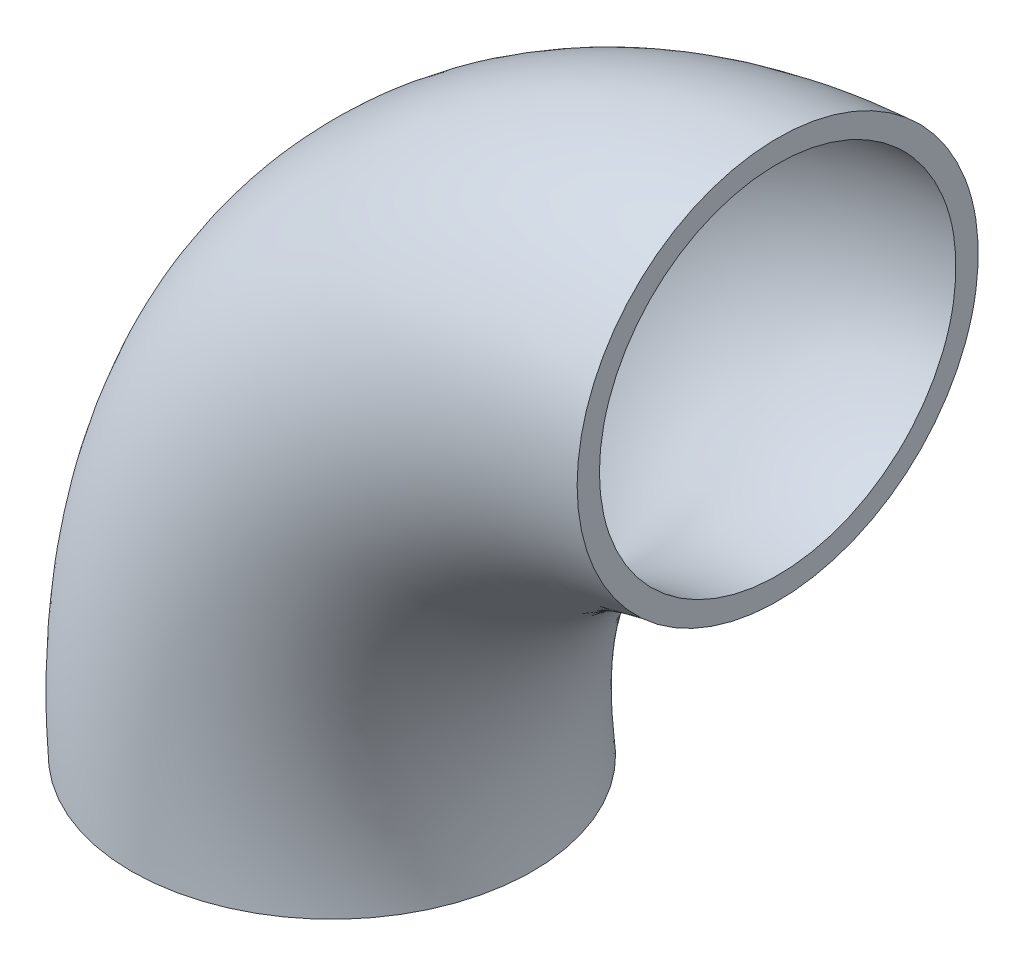
ISO-10303-21;
HEADER;
FILE_DESCRIPTION(('STEP AP214'),'2;1');
FILE_NAME('part.step','',(''),(''),'','','');
FILE_SCHEMA(('AUTOMOTIVE_DESIGN { 1 0 10303 214 1 1 1 1 }'));
ENDSEC;
DATA;
#1=APPLICATION_CONTEXT('core data for automotive mechanical design processes');
#2=APPLICATION_PROTOCOL_DEFINITION('international standard','automotive_design',2000,#1);
#3=PRODUCT_CONTEXT('',#1,'mechanical');
#4=PRODUCT('Part','Part','',(#3));
#5=PRODUCT_RELATED_PRODUCT_CATEGORY('part','',(#4));
#6=PRODUCT_DEFINITION_FORMATION('','',#4);
#7=PRODUCT_DEFINITION_CONTEXT('part definition',#1,'design');
#8=PRODUCT_DEFINITION('design','',#6,#7);
#9=PRODUCT_DEFINITION_SHAPE('','',#8);
#10=(LENGTH_UNIT() NAMED_UNIT(*) SI_UNIT(.MILLI.,.METRE.));
#11=(NAMED_UNIT(*) PLANE_ANGLE_UNIT() SI_UNIT($,.RADIAN.));
#12=(NAMED_UNIT(*) SI_UNIT($,.STERADIAN.) SOLID_ANGLE_UNIT());
#13=UNCERTAINTY_MEASURE_WITH_UNIT(LENGTH_MEASURE(1.E-05),#10,'distance_accuracy_value','');
#14=(GEOMETRIC_REPRESENTATION_CONTEXT(3) GLOBAL_UNCERTAINTY_ASSIGNED_CONTEXT((#13)) GLOBAL_UNIT_ASSIGNED_CONTEXT((#10,
#11,#12)) REPRESENTATION_CONTEXT('',''));
#15=CARTESIAN_POINT('',(0.,0.,0.));
#16=DIRECTION('',(0.,0.,1.));
#17=DIRECTION('',(1.,0.,0.));
#18=AXIS2_PLACEMENT_3D('',#15,#16,#17);
#19=CARTESIAN_POINT('',(0.,0.,18.));
#20=CARTESIAN_POINT('',(-2.92893218813447,26.3603896932107,18.));
#21=CARTESIAN_POINT('',(13.6396103067893,47.0710678118654,18.));
#22=CARTESIAN_POINT('',(40.,50.,18.));
#23=CARTESIAN_POINT('',(36.,0.,18.));
#24=CARTESIAN_POINT('',(33.0710678118655,5.27207793864219,18.));
#25=CARTESIAN_POINT('',(34.727922061358,11.0710678118655,18.));
#26=CARTESIAN_POINT('',(40.0000000000002,14.,18.));
#27=CARTESIAN_POINT('',(36.,0.,-18.));
#28=CARTESIAN_POINT('',(33.0710678118655,5.27207793864219,-18.));
#29=CARTESIAN_POINT('',(34.727922061358,11.0710678118655,-18.));
#30=CARTESIAN_POINT('',(40.0000000000002,14.,-18.));
#31=CARTESIAN_POINT('',(0.,0.,-18.));
#32=CARTESIAN_POINT('',(-2.92893218813446,26.3603896932107,-18.));
#33=CARTESIAN_POINT('',(13.6396103067893,47.0710678118654,-18.));
#34=CARTESIAN_POINT('',(40.,50.,-18.));
#35=CARTESIAN_POINT('',(-36.,0.,-18.));
#36=CARTESIAN_POINT('',(-38.9289321881345,47.4487014477792,-18.));
#37=CARTESIAN_POINT('',(-7.44870144777933,83.0710678118653,-18.));
#38=CARTESIAN_POINT('',(39.9999999999999,86.,-18.));
#39=CARTESIAN_POINT('',(-36.,0.,18.));
#40=CARTESIAN_POINT('',(-38.9289321881345,47.4487014477792,18.));
#41=CARTESIAN_POINT('',(-7.44870144777933,83.0710678118653,18.));
#42=CARTESIAN_POINT('',(39.9999999999999,86.,18.));
#43=CARTESIAN_POINT('',(0.,0.,18.));
#44=CARTESIAN_POINT('',(-2.92893218813447,26.3603896932107,18.));
#45=CARTESIAN_POINT('',(13.6396103067893,47.0710678118654,18.));
#46=CARTESIAN_POINT('',(40.,50.,18.));
#47=(BOUNDED_SURFACE() B_SPLINE_SURFACE(3,3,((#19,#20,#21,#22),(#23,#24,#25,#26),(#27,#28,#29,
#30),(#31,#32,#33,#34),(#35,#36,#37,#38),(#39,#40,#41,#42),(#43,#44,#45,#46)),.UNSPECIFIED.,.T.,
.F.,.F.) B_SPLINE_SURFACE_WITH_KNOTS((4,3,4),(4,4),(0.,0.5,1.),(0.,1.),
.UNSPECIFIED.) GEOMETRIC_REPRESENTATION_ITEM() RATIONAL_B_SPLINE_SURFACE(((1.,0.804737854124366,
0.804737854124366,1.),(0.333333333333333,0.268245951374789,0.268245951374789,0.333333333333333),
(0.333333333333333,0.268245951374789,0.268245951374789,0.333333333333333),(1.,0.804737854124366,
0.804737854124366,1.),(0.333333333333333,0.268245951374789,0.268245951374789,0.333333333333333),
(0.333333333333333,0.268245951374789,0.268245951374789,0.333333333333333),(1.,0.804737854124366,
0.804737854124366,1.))) REPRESENTATION_ITEM('') SURFACE());
#48=CARTESIAN_POINT('',(40.,50.,0.));
#49=DIRECTION('',(1.,0.,0.));
#50=DIRECTION('',(0.,0.,1.));
#51=AXIS2_PLACEMENT_3D('',#48,#49,#50);
#52=CIRCLE('',#51,18.);
#53=CARTESIAN_POINT('',(40.,50.,18.));
#54=VERTEX_POINT('',#53);
#55=EDGE_CURVE('E53',#54,#54,#52,.T.);
#56=CARTESIAN_POINT('',(0.,0.,0.));
#57=DIRECTION('',(0.,1.,0.));
#58=DIRECTION('',(0.,0.,1.));
#59=AXIS2_PLACEMENT_3D('',#56,#57,#58);
#60=CIRCLE('',#59,18.);
#61=CARTESIAN_POINT('',(0.,0.,18.));
#62=VERTEX_POINT('',#61);
#63=EDGE_CURVE('E38',#62,#62,#60,.T.);
#64=ORIENTED_EDGE('',*,*,#55,.F.);
#65=EDGE_LOOP('',(#64));
#66=FACE_BOUND('',#65,.T.);
#67=ORIENTED_EDGE('',*,*,#63,.T.);
#68=EDGE_LOOP('',(#67));
#69=FACE_BOUND('',#68,.T.);
#70=ADVANCED_FACE('F33',(#66,#69),#47,.T.);
#71=CARTESIAN_POINT('',(0.,0.,0.));
#72=DIRECTION('',(0.,1.,0.));
#73=DIRECTION('',(0.,0.,1.));
#74=AXIS2_PLACEMENT_3D('',#71,#72,#73);
#75=PLANE('',#74);
#76=CARTESIAN_POINT('',(0.,0.,0.));
#77=DIRECTION('',(0.,1.,0.));
#78=DIRECTION('',(0.,0.,1.));
#79=AXIS2_PLACEMENT_3D('',#76,#77,#78);
#80=CIRCLE('',#79,16.);
#81=CARTESIAN_POINT('',(0.,0.,16.));
#82=VERTEX_POINT('',#81);
#83=EDGE_CURVE('E43',#82,#82,#80,.F.);
#84=ORIENTED_EDGE('',*,*,#83,.F.);
#85=EDGE_LOOP('',(#84));
#86=FACE_BOUND('',#85,.T.);
#87=ORIENTED_EDGE('',*,*,#63,.F.);
#88=EDGE_LOOP('',(#87));
#89=FACE_BOUND('',#88,.T.);
#90=ADVANCED_FACE('F71',(#86,#89),#75,.F.);
#91=CARTESIAN_POINT('',(40.,50.,0.));
#92=DIRECTION('',(1.,0.,0.));
#93=DIRECTION('',(0.,0.,1.));
#94=AXIS2_PLACEMENT_3D('',#91,#92,#93);
#95=PLANE('',#94);
#96=CARTESIAN_POINT('',(40.,50.,0.));
#97=DIRECTION('',(1.,0.,0.));
#98=DIRECTION('',(0.,0.,1.));
#99=AXIS2_PLACEMENT_3D('',#96,#97,#98);
#100=CIRCLE('',#99,16.);
#101=CARTESIAN_POINT('',(40.,50.,16.));
#102=VERTEX_POINT('',#101);
#103=EDGE_CURVE('E11',#102,#102,#100,.F.);
#104=ORIENTED_EDGE('',*,*,#103,.T.);
#105=EDGE_LOOP('',(#104));
#106=FACE_BOUND('',#105,.T.);
#107=ORIENTED_EDGE('',*,*,#55,.T.);
#108=EDGE_LOOP('',(#107));
#109=FACE_BOUND('',#108,.T.);
#110=ADVANCED_FACE('F60',(#106,#109),#95,.T.);
#111=CARTESIAN_POINT('',(0.,0.,16.));
#112=CARTESIAN_POINT('',(-2.92893218813447,26.3603896932107,16.));
#113=CARTESIAN_POINT('',(13.6396103067893,47.0710678118654,16.));
#114=CARTESIAN_POINT('',(40.,50.,16.));
#115=CARTESIAN_POINT('',(-32.,0.,16.));
#116=CARTESIAN_POINT('',(-34.9289321881345,45.1055556972716,16.));
#117=CARTESIAN_POINT('',(-5.1055556972717,79.0710678118653,16.));
#118=CARTESIAN_POINT('',(39.9999999999999,82.,16.));
#119=CARTESIAN_POINT('',(-32.,0.,-16.));
#120=CARTESIAN_POINT('',(-34.9289321881345,45.1055556972716,-16.));
#121=CARTESIAN_POINT('',(-5.1055556972717,79.0710678118653,-16.));
#122=CARTESIAN_POINT('',(39.9999999999999,82.,-16.));
#123=CARTESIAN_POINT('',(0.,0.,-16.));
#124=CARTESIAN_POINT('',(-2.92893218813446,26.3603896932107,-16.));
#125=CARTESIAN_POINT('',(13.6396103067893,47.0710678118654,-16.));
#126=CARTESIAN_POINT('',(40.,50.,-16.));
#127=CARTESIAN_POINT('',(32.,0.,-16.));
#128=CARTESIAN_POINT('',(29.0710678118655,7.61522368914981,-16.));
#129=CARTESIAN_POINT('',(32.3847763108504,15.0710678118655,-16.));
#130=CARTESIAN_POINT('',(40.0000000000001,18.,-16.));
#131=CARTESIAN_POINT('',(32.,0.,16.));
#132=CARTESIAN_POINT('',(29.0710678118655,7.61522368914981,16.));
#133=CARTESIAN_POINT('',(32.3847763108504,15.0710678118655,16.));
#134=CARTESIAN_POINT('',(40.0000000000001,18.,16.));
#135=CARTESIAN_POINT('',(0.,0.,16.));
#136=CARTESIAN_POINT('',(-2.92893218813447,26.3603896932107,16.));
#137=CARTESIAN_POINT('',(13.6396103067893,47.0710678118654,16.));
#138=CARTESIAN_POINT('',(40.,50.,16.));
#139=(BOUNDED_SURFACE() B_SPLINE_SURFACE(3,3,((#111,#112,#113,#114),(#115,#116,#117,#118),(#119,
#120,#121,#122),(#123,#124,#125,#126),(#127,#128,#129,#130),(#131,#132,#133,#134),(#135,#136,
#137,#138)),.UNSPECIFIED.,.T.,.F.,.F.) B_SPLINE_SURFACE_WITH_KNOTS((4,3,4),(4,4),(0.,0.5,1.),
(0.,1.),.UNSPECIFIED.) GEOMETRIC_REPRESENTATION_ITEM() RATIONAL_B_SPLINE_SURFACE(((1.,
0.804737854124366,0.804737854124366,1.),(0.333333333333333,0.268245951374789,0.268245951374789,
0.333333333333333),(0.333333333333333,0.268245951374789,0.268245951374789,0.333333333333333),
(1.,0.804737854124366,0.804737854124366,1.),(0.333333333333333,0.268245951374789,
0.268245951374789,0.333333333333333),(0.333333333333333,0.268245951374789,0.268245951374789,
0.333333333333333),(1.,0.804737854124366,0.804737854124366,1.))) REPRESENTATION_ITEM('') SURFACE());
#140=ORIENTED_EDGE('',*,*,#103,.F.);
#141=EDGE_LOOP('',(#140));
#142=FACE_BOUND('',#141,.T.);
#143=ORIENTED_EDGE('',*,*,#83,.T.);
#144=EDGE_LOOP('',(#143));
#145=FACE_BOUND('',#144,.T.);
#146=ADVANCED_FACE('F63',(#142,#145),#139,.T.);
#147=CLOSED_SHELL('',(#70,#90,#110,#146));
#148=MANIFOLD_SOLID_BREP('B2',#147);
#149=ADVANCED_BREP_SHAPE_REPRESENTATION('',(#18,#148),#14);
#150=SHAPE_DEFINITION_REPRESENTATION(#9,#149);
ENDSEC;
END-ISO-10303-21;
